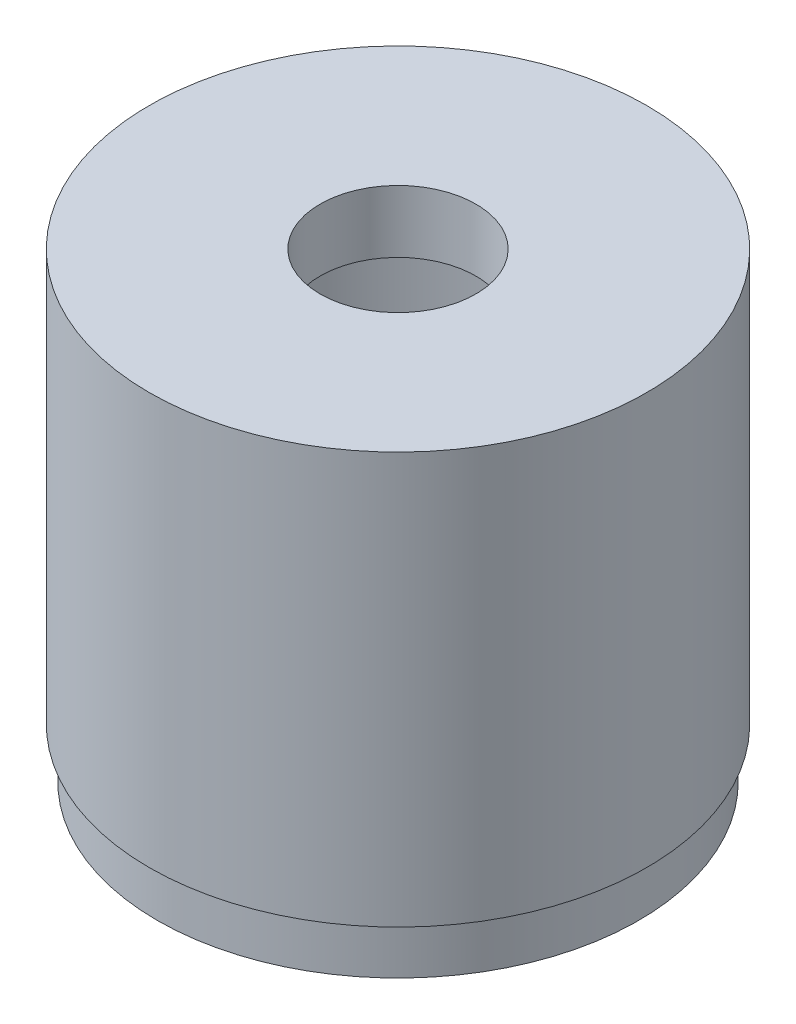
ISO-10303-21;
HEADER;
FILE_DESCRIPTION(('STEP AP214'),'2;1');
FILE_NAME('part.step','',(''),(''),'','','');
FILE_SCHEMA(('AUTOMOTIVE_DESIGN { 1 0 10303 214 1 1 1 1 }'));
ENDSEC;
DATA;
#1=APPLICATION_CONTEXT('core data for automotive mechanical design processes');
#2=APPLICATION_PROTOCOL_DEFINITION('international standard','automotive_design',2000,#1);
#3=PRODUCT_CONTEXT('',#1,'mechanical');
#4=PRODUCT('Part','Part','',(#3));
#5=PRODUCT_RELATED_PRODUCT_CATEGORY('part','',(#4));
#6=PRODUCT_DEFINITION_FORMATION('','',#4);
#7=PRODUCT_DEFINITION_CONTEXT('part definition',#1,'design');
#8=PRODUCT_DEFINITION('design','',#6,#7);
#9=PRODUCT_DEFINITION_SHAPE('','',#8);
#10=(LENGTH_UNIT() NAMED_UNIT(*) SI_UNIT(.MILLI.,.METRE.));
#11=(NAMED_UNIT(*) PLANE_ANGLE_UNIT() SI_UNIT($,.RADIAN.));
#12=(NAMED_UNIT(*) SI_UNIT($,.STERADIAN.) SOLID_ANGLE_UNIT());
#13=UNCERTAINTY_MEASURE_WITH_UNIT(LENGTH_MEASURE(1.E-05),#10,'distance_accuracy_value','');
#14=(GEOMETRIC_REPRESENTATION_CONTEXT(3) GLOBAL_UNCERTAINTY_ASSIGNED_CONTEXT((#13)) GLOBAL_UNIT_ASSIGNED_CONTEXT((#10,
#11,#12)) REPRESENTATION_CONTEXT('',''));
#15=CARTESIAN_POINT('',(0.,0.,0.));
#16=DIRECTION('',(0.,0.,1.));
#17=DIRECTION('',(1.,0.,0.));
#18=AXIS2_PLACEMENT_3D('',#15,#16,#17);
#19=CARTESIAN_POINT('',(0.,40.64,0.));
#20=DIRECTION('',(0.,-1.,0.));
#21=DIRECTION('',(0.,0.,-1.));
#22=AXIS2_PLACEMENT_3D('',#19,#20,#21);
#23=CYLINDRICAL_SURFACE('',#22,24.511);
#24=CARTESIAN_POINT('',(0.,0.,0.));
#25=DIRECTION('',(0.,1.,0.));
#26=DIRECTION('',(0.,0.,1.));
#27=AXIS2_PLACEMENT_3D('',#24,#25,#26);
#28=CIRCLE('',#27,24.511);
#29=CARTESIAN_POINT('',(0.,0.,24.511));
#30=VERTEX_POINT('',#29);
#31=EDGE_CURVE('E52',#30,#30,#28,.T.);
#32=ORIENTED_EDGE('',*,*,#31,.T.);
#33=EDGE_LOOP('',(#32));
#34=FACE_BOUND('',#33,.T.);
#35=CARTESIAN_POINT('',(0.,5.08000000000001,0.));
#36=DIRECTION('',(0.,1.,0.));
#37=DIRECTION('',(0.,0.,1.));
#38=AXIS2_PLACEMENT_3D('',#35,#36,#37);
#39=CIRCLE('',#38,24.511);
#40=CARTESIAN_POINT('',(0.,5.08000000000001,24.511));
#41=VERTEX_POINT('',#40);
#42=EDGE_CURVE('E10',#41,#41,#39,.T.);
#43=ORIENTED_EDGE('',*,*,#42,.F.);
#44=EDGE_LOOP('',(#43));
#45=FACE_BOUND('',#44,.T.);
#46=ADVANCED_FACE('F45',(#34,#45),#23,.T.);
#47=CARTESIAN_POINT('',(0.,0.,0.));
#48=DIRECTION('',(0.,1.,0.));
#49=DIRECTION('',(0.,0.,1.));
#50=AXIS2_PLACEMENT_3D('',#47,#48,#49);
#51=PLANE('',#50);
#52=ORIENTED_EDGE('',*,*,#31,.F.);
#53=EDGE_LOOP('',(#52));
#54=FACE_BOUND('',#53,.T.);
#55=CARTESIAN_POINT('',(0.,0.,0.));
#56=DIRECTION('',(0.,1.,0.));
#57=DIRECTION('',(0.,0.,1.));
#58=AXIS2_PLACEMENT_3D('',#55,#56,#57);
#59=CIRCLE('',#58,21.971);
#60=CARTESIAN_POINT('',(0.,0.,21.971));
#61=VERTEX_POINT('',#60);
#62=EDGE_CURVE('E57',#61,#61,#59,.T.);
#63=ORIENTED_EDGE('',*,*,#62,.T.);
#64=EDGE_LOOP('',(#63));
#65=FACE_BOUND('',#64,.T.);
#66=ADVANCED_FACE('F97',(#54,#65),#51,.F.);
#67=CARTESIAN_POINT('',(0.,40.64,0.));
#68=DIRECTION('',(0.,-1.,0.));
#69=DIRECTION('',(0.,0.,-1.));
#70=AXIS2_PLACEMENT_3D('',#67,#68,#69);
#71=CYLINDRICAL_SURFACE('',#70,21.971);
#72=CARTESIAN_POINT('',(0.,40.64,0.));
#73=DIRECTION('',(0.,1.,0.));
#74=DIRECTION('',(0.,0.,1.));
#75=AXIS2_PLACEMENT_3D('',#72,#73,#74);
#76=CIRCLE('',#75,21.971);
#77=CARTESIAN_POINT('',(0.,40.64,21.971));
#78=VERTEX_POINT('',#77);
#79=EDGE_CURVE('E62',#78,#78,#76,.T.);
#80=ORIENTED_EDGE('',*,*,#79,.T.);
#81=EDGE_LOOP('',(#80));
#82=FACE_BOUND('',#81,.T.);
#83=ORIENTED_EDGE('',*,*,#62,.F.);
#84=EDGE_LOOP('',(#83));
#85=FACE_BOUND('',#84,.T.);
#86=ADVANCED_FACE('F101',(#82,#85),#71,.F.);
#87=CARTESIAN_POINT('',(0.,40.64,0.));
#88=DIRECTION('',(0.,1.,0.));
#89=DIRECTION('',(0.,0.,1.));
#90=AXIS2_PLACEMENT_3D('',#87,#88,#89);
#91=PLANE('',#90);
#92=CARTESIAN_POINT('',(0.,40.64,0.));
#93=DIRECTION('',(0.,1.,0.));
#94=DIRECTION('',(0.,0.,1.));
#95=AXIS2_PLACEMENT_3D('',#92,#93,#94);
#96=CIRCLE('',#95,7.9375);
#97=CARTESIAN_POINT('',(0.,40.64,7.9375));
#98=VERTEX_POINT('',#97);
#99=EDGE_CURVE('E68',#98,#98,#96,.F.);
#100=ORIENTED_EDGE('',*,*,#99,.F.);
#101=EDGE_LOOP('',(#100));
#102=FACE_BOUND('',#101,.T.);
#103=ORIENTED_EDGE('',*,*,#79,.F.);
#104=EDGE_LOOP('',(#103));
#105=FACE_BOUND('',#104,.T.);
#106=ADVANCED_FACE('F107',(#102,#105),#91,.F.);
#107=CARTESIAN_POINT('',(0.,46.99,0.));
#108=DIRECTION('',(0.,1.,0.));
#109=DIRECTION('',(0.,0.,1.));
#110=AXIS2_PLACEMENT_3D('',#107,#108,#109);
#111=PLANE('',#110);
#112=CARTESIAN_POINT('',(0.,46.99,0.));
#113=DIRECTION('',(0.,1.,0.));
#114=DIRECTION('',(0.,0.,1.));
#115=AXIS2_PLACEMENT_3D('',#112,#113,#114);
#116=CIRCLE('',#115,7.9375);
#117=CARTESIAN_POINT('',(0.,46.99,7.9375));
#118=VERTEX_POINT('',#117);
#119=EDGE_CURVE('E72',#118,#118,#116,.T.);
#120=ORIENTED_EDGE('',*,*,#119,.F.);
#121=EDGE_LOOP('',(#120));
#122=FACE_BOUND('',#121,.T.);
#123=CARTESIAN_POINT('',(0.,46.99,0.));
#124=DIRECTION('',(0.,1.,0.));
#125=DIRECTION('',(0.,0.,1.));
#126=AXIS2_PLACEMENT_3D('',#123,#124,#125);
#127=CIRCLE('',#126,25.3365);
#128=CARTESIAN_POINT('',(0.,46.99,25.3365));
#129=VERTEX_POINT('',#128);
#130=EDGE_CURVE('E77',#129,#129,#127,.T.);
#131=ORIENTED_EDGE('',*,*,#130,.T.);
#132=EDGE_LOOP('',(#131));
#133=FACE_BOUND('',#132,.T.);
#134=ADVANCED_FACE('F114',(#122,#133),#111,.T.);
#135=CARTESIAN_POINT('',(0.,-0.001000000000001,0.));
#136=DIRECTION('',(0.,1.,0.));
#137=DIRECTION('',(0.,0.,1.));
#138=AXIS2_PLACEMENT_3D('',#135,#136,#137);
#139=CYLINDRICAL_SURFACE('',#138,7.9375);
#140=ORIENTED_EDGE('',*,*,#119,.T.);
#141=EDGE_LOOP('',(#140));
#142=FACE_BOUND('',#141,.T.);
#143=ORIENTED_EDGE('',*,*,#99,.T.);
#144=EDGE_LOOP('',(#143));
#145=FACE_BOUND('',#144,.T.);
#146=ADVANCED_FACE('F94',(#142,#145),#139,.F.);
#147=CARTESIAN_POINT('',(0.,5.08000000000001,0.));
#148=DIRECTION('',(0.,1.,0.));
#149=DIRECTION('',(0.,0.,1.));
#150=AXIS2_PLACEMENT_3D('',#147,#148,#149);
#151=CYLINDRICAL_SURFACE('',#150,25.3365);
#152=CARTESIAN_POINT('',(0.,5.08000000000001,0.));
#153=DIRECTION('',(0.,1.,0.));
#154=DIRECTION('',(0.,0.,1.));
#155=AXIS2_PLACEMENT_3D('',#152,#153,#154);
#156=CIRCLE('',#155,25.3365);
#157=CARTESIAN_POINT('',(0.,5.08000000000001,25.3365));
#158=VERTEX_POINT('',#157);
#159=EDGE_CURVE('E76',#158,#158,#156,.T.);
#160=ORIENTED_EDGE('',*,*,#159,.T.);
#161=EDGE_LOOP('',(#160));
#162=FACE_BOUND('',#161,.T.);
#163=ORIENTED_EDGE('',*,*,#130,.F.);
#164=EDGE_LOOP('',(#163));
#165=FACE_BOUND('',#164,.T.);
#166=ADVANCED_FACE('F85',(#162,#165),#151,.T.);
#167=CARTESIAN_POINT('',(0.,5.08000000000001,0.));
#168=DIRECTION('',(0.,1.,0.));
#169=DIRECTION('',(0.,0.,1.));
#170=AXIS2_PLACEMENT_3D('',#167,#168,#169);
#171=PLANE('',#170);
#172=ORIENTED_EDGE('',*,*,#42,.T.);
#173=EDGE_LOOP('',(#172));
#174=FACE_BOUND('',#173,.T.);
#175=ORIENTED_EDGE('',*,*,#159,.F.);
#176=EDGE_LOOP('',(#175));
#177=FACE_BOUND('',#176,.T.);
#178=ADVANCED_FACE('F88',(#174,#177),#171,.F.);
#179=CLOSED_SHELL('',(#46,#66,#86,#106,#134,#146,#166,#178));
#180=MANIFOLD_SOLID_BREP('B2',#179);
#181=ADVANCED_BREP_SHAPE_REPRESENTATION('',(#18,#180),#14);
#182=SHAPE_DEFINITION_REPRESENTATION(#9,#181);
ENDSEC;
END-ISO-10303-21;
